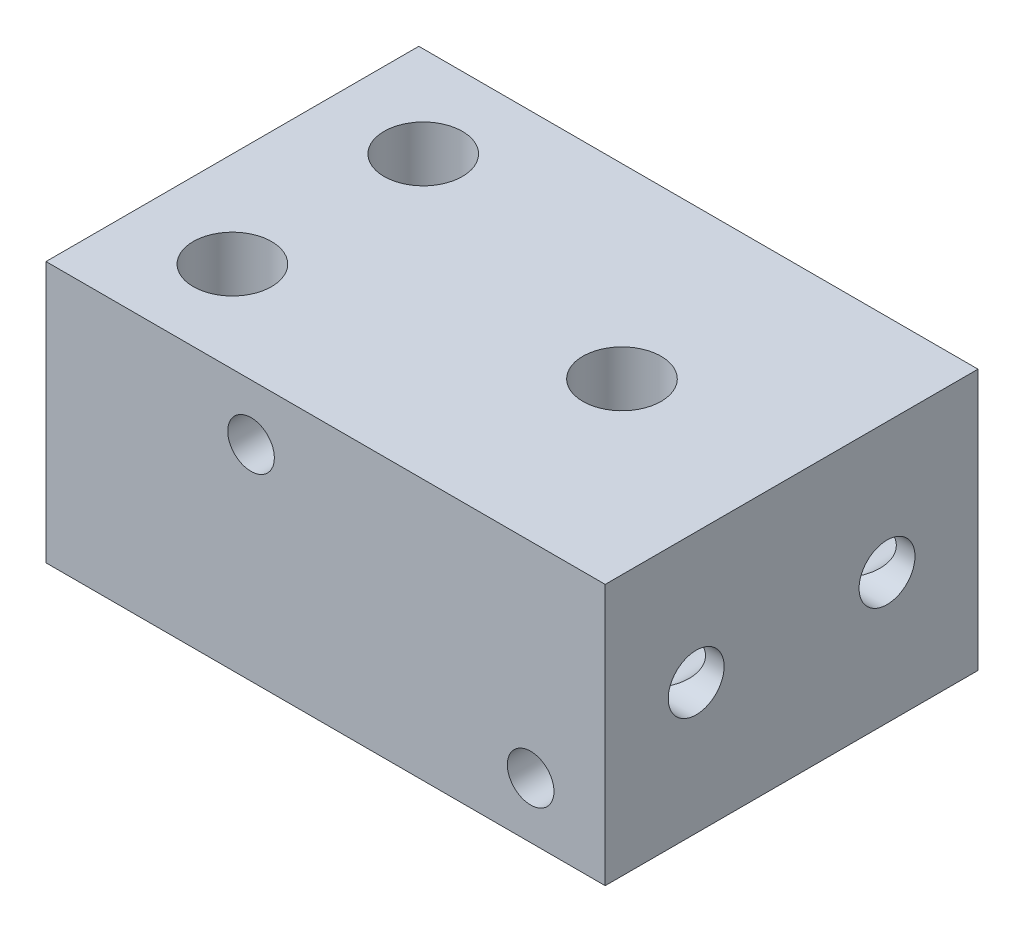
ISO-10303-21;
HEADER;
FILE_DESCRIPTION(('STEP AP214'),'2;1');
FILE_NAME('part.step','',(''),(''),'','','');
FILE_SCHEMA(('AUTOMOTIVE_DESIGN { 1 0 10303 214 1 1 1 1 }'));
ENDSEC;
DATA;
#1=APPLICATION_CONTEXT('core data for automotive mechanical design processes');
#2=APPLICATION_PROTOCOL_DEFINITION('international standard','automotive_design',2000,#1);
#3=PRODUCT_CONTEXT('',#1,'mechanical');
#4=PRODUCT('Part','Part','',(#3));
#5=PRODUCT_RELATED_PRODUCT_CATEGORY('part','',(#4));
#6=PRODUCT_DEFINITION_FORMATION('','',#4);
#7=PRODUCT_DEFINITION_CONTEXT('part definition',#1,'design');
#8=PRODUCT_DEFINITION('design','',#6,#7);
#9=PRODUCT_DEFINITION_SHAPE('','',#8);
#10=(LENGTH_UNIT() NAMED_UNIT(*) SI_UNIT(.MILLI.,.METRE.));
#11=(NAMED_UNIT(*) PLANE_ANGLE_UNIT() SI_UNIT($,.RADIAN.));
#12=(NAMED_UNIT(*) SI_UNIT($,.STERADIAN.) SOLID_ANGLE_UNIT());
#13=UNCERTAINTY_MEASURE_WITH_UNIT(LENGTH_MEASURE(1.E-05),#10,'distance_accuracy_value','');
#14=(GEOMETRIC_REPRESENTATION_CONTEXT(3) GLOBAL_UNCERTAINTY_ASSIGNED_CONTEXT((#13)) GLOBAL_UNIT_ASSIGNED_CONTEXT((#10,
#11,#12)) REPRESENTATION_CONTEXT('',''));
#15=CARTESIAN_POINT('',(0.,0.,0.));
#16=DIRECTION('',(0.,0.,1.));
#17=DIRECTION('',(1.,0.,0.));
#18=AXIS2_PLACEMENT_3D('',#15,#16,#17);
#19=CARTESIAN_POINT('',(12.5,0.,5.));
#20=DIRECTION('',(0.,0.,-1.));
#21=DIRECTION('',(-1.,0.,0.));
#22=AXIS2_PLACEMENT_3D('',#19,#20,#21);
#23=CONICAL_SURFACE('',#22,1.5,1.02974425867665);
#24=CARTESIAN_POINT('',(12.5,0.,5.));
#25=DIRECTION('',(0.,0.,-1.));
#26=DIRECTION('',(-1.,0.,0.));
#27=AXIS2_PLACEMENT_3D('',#24,#25,#26);
#28=CIRCLE('',#27,1.5);
#29=CARTESIAN_POINT('',(12.381197846483,1.49528794829615,5.));
#30=VERTEX_POINT('',#29);
#31=CARTESIAN_POINT('',(12.618802153517,1.49528794829615,5.));
#32=VERTEX_POINT('',#31);
#33=EDGE_CURVE('E201',#30,#32,#28,.T.);
#34=ORIENTED_EDGE('',*,*,#33,.T.);
#35=CARTESIAN_POINT('',(13.5805534889174,1.46712130148021,4.80646405666845));
#36=CARTESIAN_POINT('',(13.5211839333403,1.47120765001717,4.82562818840708));
#37=CARTESIAN_POINT('',(13.4614929430071,1.47471254752651,4.84396772708153));
#38=CARTESIAN_POINT('',(13.3410766330989,1.4807400282696,4.87856374212805));
#39=CARTESIAN_POINT('',(13.2803472627921,1.48325661187412,4.89480710583845));
#40=CARTESIAN_POINT('',(13.1461494135594,1.48785501496003,4.92746003463698));
#41=CARTESIAN_POINT('',(13.0725260388537,1.48975379250092,4.94327314428095));
#42=CARTESIAN_POINT('',(12.9243600891772,1.49264595093046,4.96984422397205));
#43=CARTESIAN_POINT('',(12.8498178478908,1.4936396512178,4.98060397668201));
#44=CARTESIAN_POINT('',(12.7003748398081,1.4949897719448,4.99605176300288));
#45=CARTESIAN_POINT('',(12.6254765881037,1.49534865129621,5.0007632045589));
#46=CARTESIAN_POINT('',(12.4755592029223,1.49557576103578,5.00366486201252));
#47=CARTESIAN_POINT('',(12.4005401003839,1.49544410163823,5.00185654277357));
#48=CARTESIAN_POINT('',(12.2798414819185,1.494789430497,4.99385797566924));
#49=CARTESIAN_POINT('',(12.2340189489433,1.49443717538625,4.98962949763607));
#50=CARTESIAN_POINT('',(12.1426377706661,1.49347866923835,4.97897869691298));
#51=CARTESIAN_POINT('',(12.0970790932178,1.49287244983172,4.97255664744439));
#52=CARTESIAN_POINT('',(12.0061739011284,1.49134427024508,4.95771955192739));
#53=CARTESIAN_POINT('',(11.9608282561015,1.49042148628245,4.94929932390386));
#54=CARTESIAN_POINT('',(11.8705057226256,1.48819161147023,4.93072419356039));
#55=CARTESIAN_POINT('',(11.8255288423373,1.48688451213924,4.92056925295947));
#56=CARTESIAN_POINT('',(11.707731272971,1.4828481686182,4.89190565678009));
#57=CARTESIAN_POINT('',(11.6352228125566,1.47974178042864,4.87216504258061));
#58=CARTESIAN_POINT('',(11.4911596572071,1.47203236519833,4.82968802007176));
#59=CARTESIAN_POINT('',(11.4196052765039,1.46742885715736,4.8069506503518));
#60=CARTESIAN_POINT('',(11.2772941431457,1.45646757905973,4.75921517731361));
#61=CARTESIAN_POINT('',(11.2065384923606,1.45010763581239,4.73421429934292));
#62=CARTESIAN_POINT('',(11.0658400268724,1.43541277364258,4.68255386750521));
#63=CARTESIAN_POINT('',(10.9958972975374,1.42707764922945,4.65589414127062));
#64=CARTESIAN_POINT('',(10.7872784123957,1.39880881562895,4.57414333852019));
#65=CARTESIAN_POINT('',(10.6497319617632,1.37560597661754,4.51725279842159));
#66=CARTESIAN_POINT('',(10.3779157998649,1.31881732231994,4.40122943872389));
#67=CARTESIAN_POINT('',(10.2436422739382,1.28524428607685,4.34209945701003));
#68=CARTESIAN_POINT('',(10.0474977438105,1.22610794996405,4.25401768587328));
#69=CARTESIAN_POINT('',(9.98407489535697,1.20537346967524,4.22526410135167));
#70=CARTESIAN_POINT('',(9.85843536603288,1.16061249939114,4.16785913704675));
#71=CARTESIAN_POINT('',(9.79621764369038,1.13658901124604,4.1392076882338));
#72=CARTESIAN_POINT('',(9.73467523557029,1.11072713994722,4.11069242705632));
#73=B_SPLINE_CURVE_WITH_KNOTS('',3,(#35,#36,#37,#38,#39,#40,#41,#42,#43,#44,#45,#46,#47,#48,#49,
#50,#51,#52,#53,#54,#55,#56,#57,#58,#59,#60,#61,#62,#63,#64,#65,#66,#67,#68,#69,#70,#71,#72),
.UNSPECIFIED.,.F.,.F.,(4,2,2,2,2,2,2,2,2,2,2,2,2,2,2,2,2,2,4),(0.,0.187570776768924,
0.376263236548159,0.602092023812306,0.827841085947331,1.05271380227868,1.27753599723375,
1.41554129961895,1.55352941895275,1.69187937756897,1.83023238963366,2.055759817394,
2.28135977514527,2.50724012201256,2.73314397897271,3.18469869600807,3.63569917380241,
3.85359743659616,4.07129813502256),.UNSPECIFIED.);
#74=EDGE_CURVE('E11',#32,#30,#73,.T.);
#75=ORIENTED_EDGE('',*,*,#74,.T.);
#76=EDGE_LOOP('',(#34,#75));
#77=FACE_BOUND('',#76,.T.);
#78=ADVANCED_FACE('F43',(#77),#23,.F.);
#79=CARTESIAN_POINT('',(12.5,0.,-10.));
#80=DIRECTION('',(0.,0.,-1.));
#81=DIRECTION('',(-1.,0.,0.));
#82=AXIS2_PLACEMENT_3D('',#79,#80,#81);
#83=CYLINDRICAL_SURFACE('',#82,1.49999999999999);
#84=CARTESIAN_POINT('',(12.5,0.,-10.));
#85=DIRECTION('',(0.,0.,-1.));
#86=DIRECTION('',(-1.,0.,0.));
#87=AXIS2_PLACEMENT_3D('',#84,#85,#86);
#88=CIRCLE('',#87,1.49999999999999);
#89=CARTESIAN_POINT('',(11.,0.,-10.));
#90=VERTEX_POINT('',#89);
#91=EDGE_CURVE('E209',#90,#90,#88,.T.);
#92=ORIENTED_EDGE('',*,*,#91,.T.);
#93=EDGE_LOOP('',(#92));
#94=FACE_BOUND('',#93,.T.);
#95=CARTESIAN_POINT('',(12.5,0.,-5.11880215351701));
#96=DIRECTION('',(-0.707106781186547,0.,-0.707106781186547));
#97=DIRECTION('',(0.707106781186547,0.,-0.707106781186547));
#98=AXIS2_PLACEMENT_3D('',#95,#96,#97);
#99=ELLIPSE('',#98,2.12132034355963,1.49999999999999);
#100=CARTESIAN_POINT('',(12.5,-1.49999999999999,-5.11880215351701));
#101=VERTEX_POINT('',#100);
#102=CARTESIAN_POINT('',(12.5,1.49999999999999,-5.11880215351701));
#103=VERTEX_POINT('',#102);
#104=EDGE_CURVE('E70',#101,#103,#99,.F.);
#105=ORIENTED_EDGE('',*,*,#104,.T.);
#106=CARTESIAN_POINT('',(12.5,0.,-5.11880215351701));
#107=DIRECTION('',(0.707106781186547,0.,-0.707106781186547));
#108=DIRECTION('',(-0.707106781186547,0.,-0.707106781186547));
#109=AXIS2_PLACEMENT_3D('',#106,#107,#108);
#110=ELLIPSE('',#109,2.12132034355963,1.49999999999999);
#111=EDGE_CURVE('E351',#103,#101,#110,.F.);
#112=ORIENTED_EDGE('',*,*,#111,.T.);
#113=EDGE_LOOP('',(#105,#112));
#114=FACE_BOUND('',#113,.T.);
#115=ADVANCED_FACE('F188',(#94,#114),#83,.F.);
#116=CARTESIAN_POINT('',(15.,-7.,10.));
#117=DIRECTION('',(-1.,0.,0.));
#118=DIRECTION('',(0.,0.,1.));
#119=AXIS2_PLACEMENT_3D('',#116,#117,#118);
#120=PLANE('',#119);
#121=CARTESIAN_POINT('',(15.,0.,5.11880215351701));
#122=DIRECTION('',(1.,0.,0.));
#123=DIRECTION('',(0.,0.,-1.));
#124=AXIS2_PLACEMENT_3D('',#121,#122,#123);
#125=CIRCLE('',#124,1.49999999999999);
#126=CARTESIAN_POINT('',(15.,0.,3.61880215351702));
#127=VERTEX_POINT('',#126);
#128=EDGE_CURVE('E139',#127,#127,#125,.T.);
#129=ORIENTED_EDGE('',*,*,#128,.F.);
#130=EDGE_LOOP('',(#129));
#131=FACE_BOUND('',#130,.T.);
#132=CARTESIAN_POINT('',(15.,0.,-5.11880215351701));
#133=DIRECTION('',(1.,0.,0.));
#134=DIRECTION('',(0.,0.,-1.));
#135=AXIS2_PLACEMENT_3D('',#132,#133,#134);
#136=CIRCLE('',#135,1.49999999999999);
#137=CARTESIAN_POINT('',(15.,0.,-6.618802153517));
#138=VERTEX_POINT('',#137);
#139=EDGE_CURVE('E152',#138,#138,#136,.T.);
#140=ORIENTED_EDGE('',*,*,#139,.F.);
#141=EDGE_LOOP('',(#140));
#142=FACE_BOUND('',#141,.T.);
#143=DIRECTION('',(0.,1.,0.));
#144=VECTOR('',#143,1.);
#145=CARTESIAN_POINT('',(15.,-7.,-10.));
#146=LINE('',#145,#144);
#147=CARTESIAN_POINT('',(15.,-7.,-10.));
#148=VERTEX_POINT('',#147);
#149=CARTESIAN_POINT('',(15.,7.,-10.));
#150=VERTEX_POINT('',#149);
#151=EDGE_CURVE('E231',#148,#150,#146,.T.);
#152=ORIENTED_EDGE('',*,*,#151,.T.);
#153=DIRECTION('',(0.,0.,-1.));
#154=VECTOR('',#153,1.);
#155=CARTESIAN_POINT('',(15.,7.,10.));
#156=LINE('',#155,#154);
#157=CARTESIAN_POINT('',(15.,7.,10.));
#158=VERTEX_POINT('',#157);
#159=EDGE_CURVE('E174',#158,#150,#156,.T.);
#160=ORIENTED_EDGE('',*,*,#159,.F.);
#161=DIRECTION('',(0.,1.,0.));
#162=VECTOR('',#161,1.);
#163=CARTESIAN_POINT('',(15.,-7.,10.));
#164=LINE('',#163,#162);
#165=CARTESIAN_POINT('',(15.,-7.,10.));
#166=VERTEX_POINT('',#165);
#167=EDGE_CURVE('E232',#166,#158,#164,.T.);
#168=ORIENTED_EDGE('',*,*,#167,.F.);
#169=DIRECTION('',(0.,0.,-1.));
#170=VECTOR('',#169,1.);
#171=CARTESIAN_POINT('',(15.,-7.,10.));
#172=LINE('',#171,#170);
#173=EDGE_CURVE('E242',#166,#148,#172,.T.);
#174=ORIENTED_EDGE('',*,*,#173,.T.);
#175=EDGE_LOOP('',(#152,#160,#168,#174));
#176=FACE_BOUND('',#175,.T.);
#177=ADVANCED_FACE('F45',(#131,#142,#176),#120,.F.);
#178=CARTESIAN_POINT('',(-15.,7.,10.));
#179=DIRECTION('',(0.,-1.,0.));
#180=DIRECTION('',(0.,0.,-1.));
#181=AXIS2_PLACEMENT_3D('',#178,#179,#180);
#182=PLANE('',#181);
#183=CARTESIAN_POINT('',(-9.881197846483,7.,5.11880215351701));
#184=DIRECTION('',(0.,1.,0.));
#185=DIRECTION('',(0.,0.,1.));
#186=AXIS2_PLACEMENT_3D('',#183,#184,#185);
#187=CIRCLE('',#186,2.09999999999999);
#188=CARTESIAN_POINT('',(-9.881197846483,7.,7.218802153517));
#189=VERTEX_POINT('',#188);
#190=EDGE_CURVE('E202',#189,#189,#187,.T.);
#191=ORIENTED_EDGE('',*,*,#190,.F.);
#192=EDGE_LOOP('',(#191));
#193=FACE_BOUND('',#192,.T.);
#194=CARTESIAN_POINT('',(-9.881197846483,7.,-5.11880215351701));
#195=DIRECTION('',(0.,1.,0.));
#196=DIRECTION('',(0.,0.,1.));
#197=AXIS2_PLACEMENT_3D('',#194,#195,#196);
#198=CIRCLE('',#197,2.09999999999999);
#199=CARTESIAN_POINT('',(-9.881197846483,7.,-3.01880215351702));
#200=VERTEX_POINT('',#199);
#201=EDGE_CURVE('E215',#200,#200,#198,.T.);
#202=ORIENTED_EDGE('',*,*,#201,.F.);
#203=EDGE_LOOP('',(#202));
#204=FACE_BOUND('',#203,.T.);
#205=CARTESIAN_POINT('',(5.90000000000001,7.,0.));
#206=DIRECTION('',(0.,1.,0.));
#207=DIRECTION('',(0.,0.,1.));
#208=AXIS2_PLACEMENT_3D('',#205,#206,#207);
#209=CIRCLE('',#208,2.09999999999999);
#210=CARTESIAN_POINT('',(5.90000000000001,7.,2.09999999999999));
#211=VERTEX_POINT('',#210);
#212=EDGE_CURVE('E221',#211,#211,#209,.T.);
#213=ORIENTED_EDGE('',*,*,#212,.F.);
#214=EDGE_LOOP('',(#213));
#215=FACE_BOUND('',#214,.T.);
#216=DIRECTION('',(-1.,0.,0.));
#217=VECTOR('',#216,1.);
#218=CARTESIAN_POINT('',(-15.,7.,-10.));
#219=LINE('',#218,#217);
#220=CARTESIAN_POINT('',(-15.,7.,-10.));
#221=VERTEX_POINT('',#220);
#222=EDGE_CURVE('E245',#150,#221,#219,.T.);
#223=ORIENTED_EDGE('',*,*,#222,.T.);
#224=DIRECTION('',(0.,0.,-1.));
#225=VECTOR('',#224,1.);
#226=CARTESIAN_POINT('',(-15.,7.,10.));
#227=LINE('',#226,#225);
#228=CARTESIAN_POINT('',(-15.,7.,10.));
#229=VERTEX_POINT('',#228);
#230=EDGE_CURVE('E255',#229,#221,#227,.T.);
#231=ORIENTED_EDGE('',*,*,#230,.F.);
#232=DIRECTION('',(-1.,0.,0.));
#233=VECTOR('',#232,1.);
#234=CARTESIAN_POINT('',(-15.,7.,10.));
#235=LINE('',#234,#233);
#236=EDGE_CURVE('E235',#158,#229,#235,.T.);
#237=ORIENTED_EDGE('',*,*,#236,.F.);
#238=ORIENTED_EDGE('',*,*,#159,.T.);
#239=EDGE_LOOP('',(#223,#231,#237,#238));
#240=FACE_BOUND('',#239,.T.);
#241=ADVANCED_FACE('F294',(#193,#204,#215,#240),#182,.F.);
#242=CARTESIAN_POINT('',(-15.,-7.,10.));
#243=DIRECTION('',(1.,0.,0.));
#244=DIRECTION('',(0.,0.,-1.));
#245=AXIS2_PLACEMENT_3D('',#242,#243,#244);
#246=PLANE('',#245);
#247=DIRECTION('',(0.,-1.,0.));
#248=VECTOR('',#247,1.);
#249=CARTESIAN_POINT('',(-15.,-7.,-10.));
#250=LINE('',#249,#248);
#251=CARTESIAN_POINT('',(-15.,-7.,-10.));
#252=VERTEX_POINT('',#251);
#253=EDGE_CURVE('E247',#221,#252,#250,.T.);
#254=ORIENTED_EDGE('',*,*,#253,.T.);
#255=DIRECTION('',(0.,0.,-1.));
#256=VECTOR('',#255,1.);
#257=CARTESIAN_POINT('',(-15.,-7.,10.));
#258=LINE('',#257,#256);
#259=CARTESIAN_POINT('',(-15.,-7.,10.));
#260=VERTEX_POINT('',#259);
#261=EDGE_CURVE('E252',#260,#252,#258,.T.);
#262=ORIENTED_EDGE('',*,*,#261,.F.);
#263=DIRECTION('',(0.,-1.,0.));
#264=VECTOR('',#263,1.);
#265=CARTESIAN_POINT('',(-15.,-7.,10.));
#266=LINE('',#265,#264);
#267=EDGE_CURVE('E238',#229,#260,#266,.T.);
#268=ORIENTED_EDGE('',*,*,#267,.F.);
#269=ORIENTED_EDGE('',*,*,#230,.T.);
#270=EDGE_LOOP('',(#254,#262,#268,#269));
#271=FACE_BOUND('',#270,.T.);
#272=ADVANCED_FACE('F291',(#271),#246,.F.);
#273=CARTESIAN_POINT('',(-15.,-7.,10.));
#274=DIRECTION('',(0.,1.,0.));
#275=DIRECTION('',(0.,0.,1.));
#276=AXIS2_PLACEMENT_3D('',#273,#274,#275);
#277=PLANE('',#276);
#278=CARTESIAN_POINT('',(5.90000000000001,-7.,0.));
#279=DIRECTION('',(0.,1.,0.));
#280=DIRECTION('',(0.,0.,1.));
#281=AXIS2_PLACEMENT_3D('',#278,#279,#280);
#282=CIRCLE('',#281,1.);
#283=CARTESIAN_POINT('',(5.90000000000001,-7.,1.));
#284=VERTEX_POINT('',#283);
#285=EDGE_CURVE('E228',#284,#284,#282,.T.);
#286=ORIENTED_EDGE('',*,*,#285,.T.);
#287=EDGE_LOOP('',(#286));
#288=FACE_BOUND('',#287,.T.);
#289=DIRECTION('',(1.,0.,0.));
#290=VECTOR('',#289,1.);
#291=CARTESIAN_POINT('',(-15.,-7.,-10.));
#292=LINE('',#291,#290);
#293=EDGE_CURVE('E236',#252,#148,#292,.T.);
#294=ORIENTED_EDGE('',*,*,#293,.T.);
#295=ORIENTED_EDGE('',*,*,#173,.F.);
#296=DIRECTION('',(1.,0.,0.));
#297=VECTOR('',#296,1.);
#298=CARTESIAN_POINT('',(-15.,-7.,10.));
#299=LINE('',#298,#297);
#300=EDGE_CURVE('E240',#260,#166,#299,.T.);
#301=ORIENTED_EDGE('',*,*,#300,.F.);
#302=ORIENTED_EDGE('',*,*,#261,.T.);
#303=EDGE_LOOP('',(#294,#295,#301,#302));
#304=FACE_BOUND('',#303,.T.);
#305=ADVANCED_FACE('F284',(#288,#304),#277,.F.);
#306=CARTESIAN_POINT('',(0.,0.,10.));
#307=DIRECTION('',(0.,0.,-1.));
#308=DIRECTION('',(-1.,0.,0.));
#309=AXIS2_PLACEMENT_3D('',#306,#307,#308);
#310=PLANE('',#309);
#311=CARTESIAN_POINT('',(-4.,4.,10.));
#312=DIRECTION('',(0.,0.,1.));
#313=DIRECTION('',(1.,0.,0.));
#314=AXIS2_PLACEMENT_3D('',#311,#312,#313);
#315=CIRCLE('',#314,1.25);
#316=CARTESIAN_POINT('',(-2.75,4.,10.));
#317=VERTEX_POINT('',#316);
#318=EDGE_CURVE('E129',#317,#317,#315,.T.);
#319=ORIENTED_EDGE('',*,*,#318,.F.);
#320=EDGE_LOOP('',(#319));
#321=FACE_BOUND('',#320,.T.);
#322=CARTESIAN_POINT('',(11.,-4.,10.));
#323=DIRECTION('',(0.,0.,1.));
#324=DIRECTION('',(1.,0.,0.));
#325=AXIS2_PLACEMENT_3D('',#322,#323,#324);
#326=CIRCLE('',#325,1.25);
#327=CARTESIAN_POINT('',(12.25,-4.,10.));
#328=VERTEX_POINT('',#327);
#329=EDGE_CURVE('E128',#328,#328,#326,.T.);
#330=ORIENTED_EDGE('',*,*,#329,.F.);
#331=EDGE_LOOP('',(#330));
#332=FACE_BOUND('',#331,.T.);
#333=ORIENTED_EDGE('',*,*,#167,.T.);
#334=ORIENTED_EDGE('',*,*,#236,.T.);
#335=ORIENTED_EDGE('',*,*,#267,.T.);
#336=ORIENTED_EDGE('',*,*,#300,.T.);
#337=EDGE_LOOP('',(#333,#334,#335,#336));
#338=FACE_BOUND('',#337,.T.);
#339=ADVANCED_FACE('F281',(#321,#332,#338),#310,.F.);
#340=CARTESIAN_POINT('',(0.,0.,-10.));
#341=DIRECTION('',(0.,0.,-1.));
#342=DIRECTION('',(-1.,0.,0.));
#343=AXIS2_PLACEMENT_3D('',#340,#341,#342);
#344=PLANE('',#343);
#345=ORIENTED_EDGE('',*,*,#91,.F.);
#346=EDGE_LOOP('',(#345));
#347=FACE_BOUND('',#346,.T.);
#348=ORIENTED_EDGE('',*,*,#151,.F.);
#349=ORIENTED_EDGE('',*,*,#293,.F.);
#350=ORIENTED_EDGE('',*,*,#253,.F.);
#351=ORIENTED_EDGE('',*,*,#222,.F.);
#352=EDGE_LOOP('',(#348,#349,#350,#351));
#353=FACE_BOUND('',#352,.T.);
#354=ADVANCED_FACE('F277',(#347,#353),#344,.T.);
#355=CARTESIAN_POINT('',(5.90000000000001,-7.,0.));
#356=DIRECTION('',(0.,1.,0.));
#357=DIRECTION('',(0.,0.,1.));
#358=AXIS2_PLACEMENT_3D('',#355,#356,#357);
#359=CYLINDRICAL_SURFACE('',#358,1.);
#360=CARTESIAN_POINT('',(5.90000000000001,-1.66094668093032,0.));
#361=DIRECTION('',(0.,1.,0.));
#362=DIRECTION('',(0.,0.,1.));
#363=AXIS2_PLACEMENT_3D('',#360,#361,#362);
#364=CIRCLE('',#363,1.);
#365=CARTESIAN_POINT('',(5.90000000000001,-1.66094668093032,1.));
#366=VERTEX_POINT('',#365);
#367=EDGE_CURVE('E227',#366,#366,#364,.T.);
#368=ORIENTED_EDGE('',*,*,#367,.T.);
#369=EDGE_LOOP('',(#368));
#370=FACE_BOUND('',#369,.T.);
#371=ORIENTED_EDGE('',*,*,#285,.F.);
#372=EDGE_LOOP('',(#371));
#373=FACE_BOUND('',#372,.T.);
#374=ADVANCED_FACE('F262',(#370,#373),#359,.F.);
#375=CARTESIAN_POINT('',(5.90000000000001,-1.,0.));
#376=DIRECTION('',(0.,1.,0.));
#377=DIRECTION('',(0.,0.,1.));
#378=AXIS2_PLACEMENT_3D('',#375,#376,#377);
#379=CONICAL_SURFACE('',#378,2.1,1.02974425867665);
#380=CARTESIAN_POINT('',(5.90000000000001,-1.,0.));
#381=DIRECTION('',(0.,1.,0.));
#382=DIRECTION('',(0.,0.,1.));
#383=AXIS2_PLACEMENT_3D('',#380,#381,#382);
#384=CIRCLE('',#383,2.1);
#385=CARTESIAN_POINT('',(5.90000000000001,-1.,2.1));
#386=VERTEX_POINT('',#385);
#387=EDGE_CURVE('E224',#386,#386,#384,.T.);
#388=ORIENTED_EDGE('',*,*,#387,.T.);
#389=EDGE_LOOP('',(#388));
#390=FACE_BOUND('',#389,.T.);
#391=ORIENTED_EDGE('',*,*,#367,.F.);
#392=EDGE_LOOP('',(#391));
#393=FACE_BOUND('',#392,.T.);
#394=ADVANCED_FACE('F265',(#390,#393),#379,.F.);
#395=CARTESIAN_POINT('',(5.90000000000001,7.,0.));
#396=DIRECTION('',(0.,1.,0.));
#397=DIRECTION('',(0.,0.,1.));
#398=AXIS2_PLACEMENT_3D('',#395,#396,#397);
#399=CYLINDRICAL_SURFACE('',#398,2.09999999999999);
#400=ORIENTED_EDGE('',*,*,#387,.F.);
#401=EDGE_LOOP('',(#400));
#402=FACE_BOUND('',#401,.T.);
#403=ORIENTED_EDGE('',*,*,#212,.T.);
#404=EDGE_LOOP('',(#403));
#405=FACE_BOUND('',#404,.T.);
#406=ADVANCED_FACE('F267',(#402,#405),#399,.F.);
#407=CARTESIAN_POINT('',(-9.881197846483,-3.,-5.11880215351701));
#408=DIRECTION('',(0.,1.,0.));
#409=DIRECTION('',(0.,0.,1.));
#410=AXIS2_PLACEMENT_3D('',#407,#408,#409);
#411=CONICAL_SURFACE('',#410,2.1,1.02974425867665);
#412=CARTESIAN_POINT('',(-9.881197846483,-4.26180729995788,-5.11880215351701));
#413=VERTEX_POINT('',#412);
#414=VERTEX_LOOP('',#413);
#415=FACE_BOUND('',#414,.T.);
#416=CARTESIAN_POINT('',(-9.881197846483,-3.,-5.11880215351701));
#417=DIRECTION('',(0.,1.,0.));
#418=DIRECTION('',(0.,0.,1.));
#419=AXIS2_PLACEMENT_3D('',#416,#417,#418);
#420=CIRCLE('',#419,2.1);
#421=CARTESIAN_POINT('',(-9.881197846483,-3.,-3.01880215351701));
#422=VERTEX_POINT('',#421);
#423=EDGE_CURVE('E218',#422,#422,#420,.T.);
#424=ORIENTED_EDGE('',*,*,#423,.T.);
#425=EDGE_LOOP('',(#424));
#426=FACE_BOUND('',#425,.T.);
#427=ADVANCED_FACE('F274',(#415,#426),#411,.F.);
#428=CARTESIAN_POINT('',(-9.881197846483,7.,-5.11880215351701));
#429=DIRECTION('',(0.,1.,0.));
#430=DIRECTION('',(0.,0.,1.));
#431=AXIS2_PLACEMENT_3D('',#428,#429,#430);
#432=CYLINDRICAL_SURFACE('',#431,2.09999999999999);
#433=CARTESIAN_POINT('',(-8.4115040008131,0.,-6.618802153517));
#434=CARTESIAN_POINT('',(-8.41150618717333,0.0714635636138938,-6.61880352006278));
#435=CARTESIAN_POINT('',(-8.40618852010885,0.142920740316055,-6.61364783815958));
#436=CARTESIAN_POINT('',(-8.38610006506222,0.283150153378352,-6.59354628850496));
#437=CARTESIAN_POINT('',(-8.37130600829953,0.351915337444897,-6.57857632015417));
#438=CARTESIAN_POINT('',(-8.33511093691571,0.48415055796895,-6.54017258808949));
#439=CARTESIAN_POINT('',(-8.31378937465276,0.547673201048448,-6.51684005947936));
#440=CARTESIAN_POINT('',(-8.26708446422067,0.669734416739172,-6.46264657396994));
#441=CARTESIAN_POINT('',(-8.24170127424767,0.728273183331163,-6.43178591025907));
#442=CARTESIAN_POINT('',(-8.18415863966758,0.8505097655526,-6.35681650320226));
#443=CARTESIAN_POINT('',(-8.15161236381743,0.913170962990344,-6.31131447289605));
#444=CARTESIAN_POINT('',(-8.08666303022985,1.03090307484068,-6.21114784782687));
#445=CARTESIAN_POINT('',(-8.054260221023,1.08596376715725,-6.15647112848489));
#446=CARTESIAN_POINT('',(-7.98655330229606,1.19662789276359,-6.02791627240018));
#447=CARTESIAN_POINT('',(-7.95174784370755,1.25060895645527,-5.95235240485679));
#448=CARTESIAN_POINT('',(-7.88956245644219,1.34456168876167,-5.79027333758927));
#449=CARTESIAN_POINT('',(-7.86216694163587,1.38456281550647,-5.70378169497843));
#450=CARTESIAN_POINT('',(-7.82434046728451,1.43907144230565,-5.54762580808035));
#451=CARTESIAN_POINT('',(-7.81131019153573,1.45757548414395,-5.47997530299121));
#452=CARTESIAN_POINT('',(-7.79191509189284,1.484991166103,-5.3418391791467));
#453=CARTESIAN_POINT('',(-7.78554481953725,1.49391064739356,-5.27135592692715));
#454=CARTESIAN_POINT('',(-7.78002090611578,1.50164969655121,-5.12939938572692));
#455=CARTESIAN_POINT('',(-7.78088256856283,1.50044784662913,-5.05792431697499));
#456=CARTESIAN_POINT('',(-7.78977884112203,1.48796917601259,-4.91631009785875));
#457=CARTESIAN_POINT('',(-7.79781536293772,1.47668967017913,-4.84617130862638));
#458=CARTESIAN_POINT('',(-7.82006651979702,1.44512395679308,-4.71098595534768));
#459=CARTESIAN_POINT('',(-7.83411521385567,1.42507937005225,-4.6458544341617));
#460=CARTESIAN_POINT('',(-7.86731467180602,1.37696332909894,-4.520042490158));
#461=CARTESIAN_POINT('',(-7.88646647346712,1.3488902421232,-4.45936297590631));
#462=CARTESIAN_POINT('',(-7.93101356486319,1.28214889417871,-4.33682263759808));
#463=CARTESIAN_POINT('',(-7.95686692100209,1.24264824455404,-4.27558458977849));
#464=CARTESIAN_POINT('',(-8.01163291678444,1.15602759022427,-4.16025551082126));
#465=CARTESIAN_POINT('',(-8.04054864791441,1.10889986010106,-4.10617182831018));
#466=CARTESIAN_POINT('',(-8.10505800127426,0.998521429008189,-3.99626255818297));
#467=CARTESIAN_POINT('',(-8.14089961226402,0.933900211000362,-3.94195562274872));
#468=CARTESIAN_POINT('',(-8.21091993301691,0.795848226879714,-3.84453254227469));
#469=CARTESIAN_POINT('',(-8.2450987347209,0.722417948621627,-3.8014157779298));
#470=CARTESIAN_POINT('',(-8.3004201264612,0.584701290547808,-3.7358519151872));
#471=CARTESIAN_POINT('',(-8.32276493911208,0.522081275425057,-3.71093659562487));
#472=CARTESIAN_POINT('',(-8.36128460765393,0.392366677023455,-3.66943391099772));
#473=CARTESIAN_POINT('',(-8.37747087129232,0.325280639989664,-3.65283113004995));
#474=CARTESIAN_POINT('',(-8.40121936811433,0.187065072458757,-3.62884655950669));
#475=CARTESIAN_POINT('',(-8.40867942591543,0.115897675975786,-3.62157392329647));
#476=CARTESIAN_POINT('',(-8.41298607583699,-0.0270490375900716,-3.61734635010008));
#477=CARTESIAN_POINT('',(-8.40984023173068,-0.0988278821831936,-3.62038406013147));
#478=CARTESIAN_POINT('',(-8.3949798959663,-0.228834278132264,-3.63514772173579));
#479=CARTESIAN_POINT('',(-8.3846986499103,-0.287410218875746,-3.64542422357658));
#480=CARTESIAN_POINT('',(-8.35859205746869,-0.401788526424376,-3.67241894623339));
#481=CARTESIAN_POINT('',(-8.34276018770059,-0.457587541140687,-3.68914474892268));
#482=CARTESIAN_POINT('',(-8.29865693824673,-0.591756433291978,-3.73782872267146));
#483=CARTESIAN_POINT('',(-8.26806234851995,-0.668103199271479,-3.77324477812897));
#484=CARTESIAN_POINT('',(-8.20300471404867,-0.812722312389519,-3.85530685035193));
#485=CARTESIAN_POINT('',(-8.16853400056769,-0.880978084019236,-3.90197534583229));
#486=CARTESIAN_POINT('',(-8.0985588524004,-1.01035556140025,-4.00692540680899));
#487=CARTESIAN_POINT('',(-8.06304869827994,-1.0712804683555,-4.06544624787318));
#488=CARTESIAN_POINT('',(-7.99499963671742,-1.18309069807821,-4.19281203449228));
#489=CARTESIAN_POINT('',(-7.96245666834165,-1.23398985647099,-4.26164251826267));
#490=CARTESIAN_POINT('',(-7.90764089116034,-1.31748268396353,-4.39794008289675));
#491=CARTESIAN_POINT('',(-7.88456088902442,-1.35167082757653,-4.46410036068917));
#492=CARTESIAN_POINT('',(-7.84442581645036,-1.41028283943848,-4.60234556560133));
#493=CARTESIAN_POINT('',(-7.82736731915645,-1.43471226244915,-4.67442709403205));
#494=CARTESIAN_POINT('',(-7.80071189555121,-1.47261860321627,-4.82329384709438));
#495=CARTESIAN_POINT('',(-7.7911630352546,-1.48602499161945,-4.90010603230685));
#496=CARTESIAN_POINT('',(-7.78071329071332,-1.50068767663068,-5.05545670335732));
#497=CARTESIAN_POINT('',(-7.77980785126913,-1.50195037313097,-5.13399425802489));
#498=CARTESIAN_POINT('',(-7.78634844290883,-1.49278266583846,-5.28149175567095));
#499=CARTESIAN_POINT('',(-7.79290781257172,-1.48359375667473,-5.35057428145626));
#500=CARTESIAN_POINT('',(-7.81240738805193,-1.45601815982996,-5.48593050221238));
#501=CARTESIAN_POINT('',(-7.82534867626143,-1.43762991190633,-5.55220371864477));
#502=CARTESIAN_POINT('',(-7.85699295468042,-1.39200633461398,-5.68197546386741));
#503=CARTESIAN_POINT('',(-7.87582424905759,-1.36457317474537,-5.74537212982538));
#504=CARTESIAN_POINT('',(-7.91782926224488,-1.3020566279193,-5.86667224423049));
#505=CARTESIAN_POINT('',(-7.94100378243088,-1.26697182894922,-5.92457467595263));
#506=CARTESIAN_POINT('',(-7.99411908685997,-1.18415843707599,-6.04278911277192));
#507=CARTESIAN_POINT('',(-8.02455221226016,-1.13531449448497,-6.10209664917214));
#508=CARTESIAN_POINT('',(-8.08719878042027,-1.02968128612439,-6.21223424237738));
#509=CARTESIAN_POINT('',(-8.11941545339451,-0.972877298733635,-6.26304820004831));
#510=CARTESIAN_POINT('',(-8.1886830183136,-0.841580088256161,-6.36368146916034));
#511=CARTESIAN_POINT('',(-8.22561157625824,-0.76572502023064,-6.4118242883054));
#512=CARTESIAN_POINT('',(-8.29368736829738,-0.604558389784386,-6.49454817671247));
#513=CARTESIAN_POINT('',(-8.32484486295063,-0.519264049738337,-6.52915343909789));
#514=CARTESIAN_POINT('',(-8.36906867135897,-0.361652593881851,-6.57628696668147));
#515=CARTESIAN_POINT('',(-8.38467393115815,-0.291062581962284,-6.5921061682334));
#516=CARTESIAN_POINT('',(-8.40587473495606,-0.146972862947468,-6.61334671003374));
#517=CARTESIAN_POINT('',(-8.41150175266843,-0.0734830549796958,-6.61880074835396));
#518=CARTESIAN_POINT('',(-8.4115040008131,0.,-6.618802153517));
#519=B_SPLINE_CURVE_WITH_KNOTS('',3,(#433,#434,#435,#436,#437,#438,#439,#440,#441,#442,#443,
#444,#445,#446,#447,#448,#449,#450,#451,#452,#453,#454,#455,#456,#457,#458,#459,#460,#461,#462,
#463,#464,#465,#466,#467,#468,#469,#470,#471,#472,#473,#474,#475,#476,#477,#478,#479,#480,#481,
#482,#483,#484,#485,#486,#487,#488,#489,#490,#491,#492,#493,#494,#495,#496,#497,#498,#499,#500,
#501,#502,#503,#504,#505,#506,#507,#508,#509,#510,#511,#512,#513,#514,#515,#516,#517,#518),
.UNSPECIFIED.,.T.,.F.,(4,2,2,2,2,2,2,2,2,2,2,2,2,2,2,2,2,2,2,2,2,2,2,2,2,2,2,2,2,2,2,2,2,2,2,2,
2,2,2,2,2,2,4),(0.,0.214041341565725,0.428610275712224,0.64066487160188,0.85271121019711,
1.10382573355409,1.3552747629518,1.65114310955597,1.94638419755253,2.15947902773154,
2.37239939108384,2.58577042909475,2.79919833566903,3.00708108528782,3.21500614230805,
3.44611668475211,3.67746279969138,3.95147971727034,4.22548146651263,4.43776026411786,
4.64964391165512,4.86398443491502,5.07817213005315,5.25849876334786,5.43903804027731,
5.70624218404038,5.973984602927,6.2477965044865,6.5212278542102,6.75417807949529,
6.98699551758326,7.22129126143318,7.45546352144077,7.66448115880017,7.87353425836429,
8.0875021745455,8.30150960924377,8.54850648356665,8.79596634520377,9.08601786485972,
9.37554863589208,9.5963362422679,9.81642618565752),.UNSPECIFIED.);
#520=CARTESIAN_POINT('',(-8.4115040008131,0.,-6.618802153517));
#521=VERTEX_POINT('',#520);
#522=EDGE_CURVE('E175',#521,#521,#519,.T.);
#523=ORIENTED_EDGE('',*,*,#522,.T.);
#524=EDGE_LOOP('',(#523));
#525=FACE_BOUND('',#524,.T.);
#526=ORIENTED_EDGE('',*,*,#423,.F.);
#527=EDGE_LOOP('',(#526));
#528=FACE_BOUND('',#527,.T.);
#529=ORIENTED_EDGE('',*,*,#201,.T.);
#530=EDGE_LOOP('',(#529));
#531=FACE_BOUND('',#530,.T.);
#532=ADVANCED_FACE('F324',(#525,#528,#531),#432,.F.);
#533=CARTESIAN_POINT('',(-9.881197846483,-3.,5.11880215351701));
#534=DIRECTION('',(0.,1.,0.));
#535=DIRECTION('',(0.,0.,1.));
#536=AXIS2_PLACEMENT_3D('',#533,#534,#535);
#537=CONICAL_SURFACE('',#536,2.1,1.02974425867665);
#538=CARTESIAN_POINT('',(-9.881197846483,-4.26180729995788,5.11880215351701));
#539=VERTEX_POINT('',#538);
#540=VERTEX_LOOP('',#539);
#541=FACE_BOUND('',#540,.T.);
#542=CARTESIAN_POINT('',(-9.881197846483,-3.,5.11880215351701));
#543=DIRECTION('',(0.,1.,0.));
#544=DIRECTION('',(0.,0.,1.));
#545=AXIS2_PLACEMENT_3D('',#542,#543,#544);
#546=CIRCLE('',#545,2.1);
#547=CARTESIAN_POINT('',(-9.881197846483,-3.,7.218802153517));
#548=VERTEX_POINT('',#547);
#549=EDGE_CURVE('E206',#548,#548,#546,.T.);
#550=ORIENTED_EDGE('',*,*,#549,.T.);
#551=EDGE_LOOP('',(#550));
#552=FACE_BOUND('',#551,.T.);
#553=ADVANCED_FACE('F326',(#541,#552),#537,.F.);
#554=CARTESIAN_POINT('',(-9.881197846483,7.,5.11880215351701));
#555=DIRECTION('',(0.,1.,0.));
#556=DIRECTION('',(0.,0.,1.));
#557=AXIS2_PLACEMENT_3D('',#554,#555,#556);
#558=CYLINDRICAL_SURFACE('',#557,2.09999999999999);
#559=CARTESIAN_POINT('',(-8.4115040008131,0.,3.61880215351702));
#560=CARTESIAN_POINT('',(-8.41150618717333,0.0714635636138938,3.61880078697124));
#561=CARTESIAN_POINT('',(-8.40618852010885,0.142920740316055,3.62395646887443));
#562=CARTESIAN_POINT('',(-8.38610006506222,0.283150153378352,3.64405801852906));
#563=CARTESIAN_POINT('',(-8.37130600829953,0.351915337444897,3.65902798687985));
#564=CARTESIAN_POINT('',(-8.33511093691571,0.48415055796895,3.69743171894452));
#565=CARTESIAN_POINT('',(-8.31378937465276,0.547673201048448,3.72076424755465));
#566=CARTESIAN_POINT('',(-8.26708446422067,0.669734416739173,3.77495773306407));
#567=CARTESIAN_POINT('',(-8.24170127424767,0.728273183331164,3.80581839677494));
#568=CARTESIAN_POINT('',(-8.18415863966758,0.850509765552601,3.88078780383175));
#569=CARTESIAN_POINT('',(-8.15161236381743,0.913170962990343,3.92628983413796));
#570=CARTESIAN_POINT('',(-8.08666303022985,1.03090307484067,4.02645645920715));
#571=CARTESIAN_POINT('',(-8.054260221023,1.08596376715725,4.08113317854913));
#572=CARTESIAN_POINT('',(-7.98655330229606,1.19662789276359,4.20968803463383));
#573=CARTESIAN_POINT('',(-7.95174784370755,1.25060895645527,4.28525190217723));
#574=CARTESIAN_POINT('',(-7.88956245644219,1.34456168876167,4.44733096944474));
#575=CARTESIAN_POINT('',(-7.86216694163587,1.38456281550647,4.53382261205559));
#576=CARTESIAN_POINT('',(-7.82434046728451,1.43907144230565,4.68997849895366));
#577=CARTESIAN_POINT('',(-7.81131019153573,1.45757548414395,4.7576290040428));
#578=CARTESIAN_POINT('',(-7.79191509189284,1.484991166103,4.89576512788731));
#579=CARTESIAN_POINT('',(-7.78554481953725,1.49391064739356,4.96624838010686));
#580=CARTESIAN_POINT('',(-7.78002090611578,1.50164969655121,5.1082049213071));
#581=CARTESIAN_POINT('',(-7.78088256856283,1.50044784662913,5.17967999005903));
#582=CARTESIAN_POINT('',(-7.78977884112203,1.48796917601259,5.32129420917527));
#583=CARTESIAN_POINT('',(-7.79781536293772,1.47668967017913,5.39143299840764));
#584=CARTESIAN_POINT('',(-7.82006651979702,1.44512395679309,5.52661835168633));
#585=CARTESIAN_POINT('',(-7.83411521385567,1.42507937005225,5.59174987287231));
#586=CARTESIAN_POINT('',(-7.86731467180602,1.37696332909894,5.71756181687601));
#587=CARTESIAN_POINT('',(-7.88646647346712,1.3488902421232,5.77824133112771));
#588=CARTESIAN_POINT('',(-7.93101356486319,1.28214889417871,5.90078166943593));
#589=CARTESIAN_POINT('',(-7.95686692100209,1.24264824455404,5.96201971725553));
#590=CARTESIAN_POINT('',(-8.01163291678444,1.15602759022427,6.07734879621275));
#591=CARTESIAN_POINT('',(-8.04054864791441,1.10889986010106,6.13143247872383));
#592=CARTESIAN_POINT('',(-8.10505800127426,0.99852142900819,6.24134174885104));
#593=CARTESIAN_POINT('',(-8.14089961226402,0.933900211000363,6.2956486842853));
#594=CARTESIAN_POINT('',(-8.21091993301691,0.795848226879715,6.39307176475933));
#595=CARTESIAN_POINT('',(-8.2450987347209,0.722417948621628,6.43618852910422));
#596=CARTESIAN_POINT('',(-8.3004201264612,0.584701290547808,6.50175239184681));
#597=CARTESIAN_POINT('',(-8.32276493911208,0.522081275425058,6.52666771140915));
#598=CARTESIAN_POINT('',(-8.36128460765393,0.392366677023456,6.56817039603629));
#599=CARTESIAN_POINT('',(-8.37747087129232,0.325280639989665,6.58477317698406));
#600=CARTESIAN_POINT('',(-8.40121936811434,0.187065072458759,6.60875774752733));
#601=CARTESIAN_POINT('',(-8.40867942591543,0.115897675975788,6.61603038373755));
#602=CARTESIAN_POINT('',(-8.41298607583699,-0.0270490375900704,6.62025795693394));
#603=CARTESIAN_POINT('',(-8.40984023173068,-0.0988278821831922,6.61722024690255));
#604=CARTESIAN_POINT('',(-8.3949798959663,-0.228834278132263,6.60245658529822));
#605=CARTESIAN_POINT('',(-8.3846986499103,-0.287410218875744,6.59218008345744));
#606=CARTESIAN_POINT('',(-8.35859205746869,-0.401788526424374,6.56518536080062));
#607=CARTESIAN_POINT('',(-8.34276018770059,-0.457587541140686,6.54845955811133));
#608=CARTESIAN_POINT('',(-8.29865693824673,-0.591756433291976,6.49977558436255));
#609=CARTESIAN_POINT('',(-8.26806234851995,-0.668103199271477,6.46435952890505));
#610=CARTESIAN_POINT('',(-8.20300471404868,-0.812722312389517,6.38229745668209));
#611=CARTESIAN_POINT('',(-8.16853400056769,-0.880978084019234,6.33562896120173));
#612=CARTESIAN_POINT('',(-8.09855885240041,-1.01035556140025,6.23067890022503));
#613=CARTESIAN_POINT('',(-8.06304869827994,-1.0712804683555,6.17215805916084));
#614=CARTESIAN_POINT('',(-7.99499963671742,-1.1830906980782,6.04479227254174));
#615=CARTESIAN_POINT('',(-7.96245666834165,-1.23398985647098,5.97596178877134));
#616=CARTESIAN_POINT('',(-7.90764089116035,-1.31748268396352,5.83966422413727));
#617=CARTESIAN_POINT('',(-7.88456088902442,-1.35167082757653,5.77350394634485));
#618=CARTESIAN_POINT('',(-7.84442581645036,-1.41028283943848,5.63525874143269));
#619=CARTESIAN_POINT('',(-7.82736731915645,-1.43471226244915,5.56317721300197));
#620=CARTESIAN_POINT('',(-7.80071189555121,-1.47261860321627,5.41431045993964));
#621=CARTESIAN_POINT('',(-7.7911630352546,-1.48602499161945,5.33749827472717));
#622=CARTESIAN_POINT('',(-7.78071329071332,-1.50068767663068,5.1821476036767));
#623=CARTESIAN_POINT('',(-7.77980785126913,-1.50195037313097,5.10361004900913));
#624=CARTESIAN_POINT('',(-7.78634844290883,-1.49278266583846,4.95611255136307));
#625=CARTESIAN_POINT('',(-7.79290781257172,-1.48359375667473,4.88703002557776));
#626=CARTESIAN_POINT('',(-7.81240738805193,-1.45601815982996,4.75167380482164));
#627=CARTESIAN_POINT('',(-7.82534867626143,-1.43762991190633,4.68540058838925));
#628=CARTESIAN_POINT('',(-7.85699295468042,-1.39200633461399,4.55562884316661));
#629=CARTESIAN_POINT('',(-7.87582424905759,-1.36457317474537,4.49223217720864));
#630=CARTESIAN_POINT('',(-7.91782926224487,-1.3020566279193,4.37093206280353));
#631=CARTESIAN_POINT('',(-7.94100378243087,-1.26697182894922,4.31302963108139));
#632=CARTESIAN_POINT('',(-7.99411908685996,-1.184158437076,4.19481519426209));
#633=CARTESIAN_POINT('',(-8.02455221226016,-1.13531449448497,4.13550765786188));
#634=CARTESIAN_POINT('',(-8.08719878042027,-1.0296812861244,4.02537006465664));
#635=CARTESIAN_POINT('',(-8.11941545339451,-0.972877298733638,3.97455610698571));
#636=CARTESIAN_POINT('',(-8.1886830183136,-0.841580088256165,3.87392283787368));
#637=CARTESIAN_POINT('',(-8.22561157625824,-0.765725020230644,3.82578001872862));
#638=CARTESIAN_POINT('',(-8.29368736829738,-0.60455838978439,3.74305613032155));
#639=CARTESIAN_POINT('',(-8.32484486295063,-0.519264049738341,3.70845086793613));
#640=CARTESIAN_POINT('',(-8.36906867135896,-0.361652593881854,3.66131734035255));
#641=CARTESIAN_POINT('',(-8.38467393115814,-0.291062581962287,3.64549813880061));
#642=CARTESIAN_POINT('',(-8.40587473495605,-0.146972862947469,3.62425759700028));
#643=CARTESIAN_POINT('',(-8.41150175266843,-0.0734830549796963,3.61880355868006));
#644=CARTESIAN_POINT('',(-8.4115040008131,0.,3.61880215351702));
#645=B_SPLINE_CURVE_WITH_KNOTS('',3,(#559,#560,#561,#562,#563,#564,#565,#566,#567,#568,#569,
#570,#571,#572,#573,#574,#575,#576,#577,#578,#579,#580,#581,#582,#583,#584,#585,#586,#587,#588,
#589,#590,#591,#592,#593,#594,#595,#596,#597,#598,#599,#600,#601,#602,#603,#604,#605,#606,#607,
#608,#609,#610,#611,#612,#613,#614,#615,#616,#617,#618,#619,#620,#621,#622,#623,#624,#625,#626,
#627,#628,#629,#630,#631,#632,#633,#634,#635,#636,#637,#638,#639,#640,#641,#642,#643,#644),
.UNSPECIFIED.,.T.,.F.,(4,2,2,2,2,2,2,2,2,2,2,2,2,2,2,2,2,2,2,2,2,2,2,2,2,2,2,2,2,2,2,2,2,2,2,2,
2,2,2,2,2,2,4),(0.,0.214041341565725,0.428610275712224,0.640664871601882,0.85271121019711,
1.10382573355409,1.3552747629518,1.65114310955596,1.94638419755253,2.15947902773154,
2.37239939108384,2.58577042909475,2.79919833566903,3.00708108528782,3.21500614230805,
3.44611668475211,3.67746279969138,3.95147971727034,4.22548146651263,4.43776026411786,
4.64964391165512,4.86398443491501,5.07817213005315,5.25849876334785,5.43903804027731,
5.70624218404038,5.973984602927,6.2477965044865,6.52122785421019,6.75417807949529,
6.98699551758325,7.22129126143318,7.45546352144076,7.66448115880016,7.87353425836428,
8.08750217454549,8.30150960924377,8.54850648356664,8.79596634520376,9.08601786485971,
9.37554863589207,9.5963362422679,9.81642618565752),.UNSPECIFIED.);
#646=CARTESIAN_POINT('',(-8.4115040008131,0.,3.61880215351702));
#647=VERTEX_POINT('',#646);
#648=EDGE_CURVE('E146',#647,#647,#645,.T.);
#649=ORIENTED_EDGE('',*,*,#648,.T.);
#650=EDGE_LOOP('',(#649));
#651=FACE_BOUND('',#650,.T.);
#652=ORIENTED_EDGE('',*,*,#549,.F.);
#653=EDGE_LOOP('',(#652));
#654=FACE_BOUND('',#653,.T.);
#655=ORIENTED_EDGE('',*,*,#190,.T.);
#656=EDGE_LOOP('',(#655));
#657=FACE_BOUND('',#656,.T.);
#658=ADVANCED_FACE('F154',(#651,#654,#657),#558,.F.);
#659=CARTESIAN_POINT('',(15.,0.,-5.11880215351701));
#660=DIRECTION('',(1.,0.,0.));
#661=DIRECTION('',(0.,0.,-1.));
#662=AXIS2_PLACEMENT_3D('',#659,#660,#661);
#663=CYLINDRICAL_SURFACE('',#662,1.49999999999999);
#664=ORIENTED_EDGE('',*,*,#522,.F.);
#665=EDGE_LOOP('',(#664));
#666=FACE_BOUND('',#665,.T.);
#667=CARTESIAN_POINT('',(12.5,0.,-5.11880215351701));
#668=DIRECTION('',(-0.707106781186547,0.,-0.707106781186547));
#669=DIRECTION('',(0.707106781186547,0.,-0.707106781186547));
#670=AXIS2_PLACEMENT_3D('',#667,#668,#669);
#671=ELLIPSE('',#670,2.12132034355963,1.49999999999999);
#672=EDGE_CURVE('E341',#101,#103,#671,.T.);
#673=ORIENTED_EDGE('',*,*,#672,.F.);
#674=ORIENTED_EDGE('',*,*,#111,.F.);
#675=EDGE_LOOP('',(#673,#674));
#676=FACE_BOUND('',#675,.T.);
#677=ADVANCED_FACE('F165',(#666,#676),#663,.F.);
#678=ORIENTED_EDGE('',*,*,#139,.T.);
#679=EDGE_LOOP('',(#678));
#680=FACE_BOUND('',#679,.T.);
#681=ORIENTED_EDGE('',*,*,#104,.F.);
#682=CARTESIAN_POINT('',(12.5,0.,-5.11880215351701));
#683=DIRECTION('',(0.707106781186547,0.,-0.707106781186547));
#684=DIRECTION('',(-0.707106781186547,0.,-0.707106781186547));
#685=AXIS2_PLACEMENT_3D('',#682,#683,#684);
#686=ELLIPSE('',#685,2.12132034355963,1.49999999999999);
#687=EDGE_CURVE('E349',#103,#101,#686,.T.);
#688=ORIENTED_EDGE('',*,*,#687,.F.);
#689=EDGE_LOOP('',(#681,#688));
#690=FACE_BOUND('',#689,.T.);
#691=ADVANCED_FACE('F183',(#680,#690),#663,.F.);
#692=CARTESIAN_POINT('',(12.6188021535171,-1.49528794829615,5.));
#693=VERTEX_POINT('',#692);
#694=CARTESIAN_POINT('',(12.3811978464829,-1.49528794829615,5.));
#695=VERTEX_POINT('',#694);
#696=EDGE_CURVE('E203',#693,#695,#28,.T.);
#697=ORIENTED_EDGE('',*,*,#696,.T.);
#698=CARTESIAN_POINT('',(9.73467523557029,-1.11072713994722,4.11069242705632));
#699=CARTESIAN_POINT('',(9.80389792797345,-1.13980361725837,4.14276293094282));
#700=CARTESIAN_POINT('',(9.87396915570432,-1.16657075873538,4.17500818905713));
#701=CARTESIAN_POINT('',(10.0154847636144,-1.21596475930241,4.23954250270916));
#702=CARTESIAN_POINT('',(10.0869282749986,-1.23859414835945,4.27183151924106));
#703=CARTESIAN_POINT('',(10.23093337386,-1.28022064664399,4.33618019105367));
#704=CARTESIAN_POINT('',(10.3034946968883,-1.29921860114837,4.36823989803352));
#705=CARTESIAN_POINT('',(10.4496199722483,-1.33395315633314,4.431864321535));
#706=CARTESIAN_POINT('',(10.5231840892472,-1.34968921433644,4.4634289548858));
#707=CARTESIAN_POINT('',(10.6706282747695,-1.37809179938133,4.52549171217903));
#708=CARTESIAN_POINT('',(10.744501076992,-1.39078193322297,4.55599635953783));
#709=CARTESIAN_POINT('',(10.8931256267303,-1.41352024745232,4.61582688114485));
#710=CARTESIAN_POINT('',(10.9678773799786,-1.42356841059909,4.64515274769954));
#711=CARTESIAN_POINT('',(11.1182477941006,-1.44127264974914,4.70212257527298));
#712=CARTESIAN_POINT('',(11.1938659051047,-1.44893016438748,4.72976753972084));
#713=CARTESIAN_POINT('',(11.3460837705903,-1.46212558293074,4.78274750260979));
#714=CARTESIAN_POINT('',(11.4226833507932,-1.467663857901,4.80808290484817));
#715=CARTESIAN_POINT('',(11.546196392298,-1.47507499544796,4.84610054213472));
#716=CARTESIAN_POINT('',(11.5927628364,-1.47752872940951,4.85979867949423));
#717=CARTESIAN_POINT('',(11.6863939619454,-1.48185673475485,4.8858323817677));
#718=CARTESIAN_POINT('',(11.7334593956731,-1.4837299438562,4.89816542254761));
#719=CARTESIAN_POINT('',(11.8537720561741,-1.4878519608746,4.92744264121026));
#720=CARTESIAN_POINT('',(11.927317999574,-1.4897496939339,4.94323992014785));
#721=CARTESIAN_POINT('',(12.0753308519006,-1.49264097162,4.96979402429088));
#722=CARTESIAN_POINT('',(12.1497974972566,-1.49363476920913,4.98055225924135));
#723=CARTESIAN_POINT('',(12.2992427090683,-1.49498771963479,4.99602406109152));
#724=CARTESIAN_POINT('',(12.3742200606282,-1.4953480535468,5.00074887262993));
#725=CARTESIAN_POINT('',(12.5242860271404,-1.49557566516659,5.00367029561553));
#726=CARTESIAN_POINT('',(12.5993746100702,-1.49544306452507,5.00186851775451));
#727=CARTESIAN_POINT('',(12.7660952768337,-1.49454210846617,4.99080604020625));
#728=CARTESIAN_POINT('',(12.8576195195987,-1.49363646738856,4.97994729248479));
#729=CARTESIAN_POINT('',(13.0394430658459,-1.49057494314589,4.95027739512685));
#730=CARTESIAN_POINT('',(13.1297401617293,-1.48841705091068,4.93145347961447));
#731=CARTESIAN_POINT('',(13.2802647675397,-1.48325960286275,4.89482666261283));
#732=CARTESIAN_POINT('',(13.3409087708188,-1.48074707721387,4.87860839990163));
#733=CARTESIAN_POINT('',(13.46132440163,-1.47472233405473,4.84401965955841));
#734=CARTESIAN_POINT('',(13.5210981823079,-1.4712133048255,4.82565615412324));
#735=CARTESIAN_POINT('',(13.5805534889174,-1.46712130148021,4.80646405666845));
#736=B_SPLINE_CURVE_WITH_KNOTS('',3,(#698,#699,#700,#701,#702,#703,#704,#705,#706,#707,#708,
#709,#710,#711,#712,#713,#714,#715,#716,#717,#718,#719,#720,#721,#722,#723,#724,#725,#726,#727,
#728,#729,#730,#731,#732,#733,#734,#735),.UNSPECIFIED.,.F.,.F.,(4,2,2,2,2,2,2,2,2,2,2,2,2,2,2,2,
2,2,4),(0.,0.244844916623335,0.489539622174861,0.734177301414405,0.978855648069295,
1.2215715604919,1.46428905678687,1.70686020869656,1.94938886848764,2.09517136301658,
2.24121906592798,2.46680895001275,2.69233568433091,2.9174414825554,3.1424917308846,
3.41855101163197,3.69505442201481,3.88348415152079,4.07131767018498),.UNSPECIFIED.);
#737=EDGE_CURVE('E56',#695,#693,#736,.T.);
#738=ORIENTED_EDGE('',*,*,#737,.T.);
#739=EDGE_LOOP('',(#697,#738));
#740=FACE_BOUND('',#739,.T.);
#741=ADVANCED_FACE('F180',(#740),#23,.F.);
#742=ORIENTED_EDGE('',*,*,#672,.T.);
#743=ORIENTED_EDGE('',*,*,#687,.T.);
#744=EDGE_LOOP('',(#742,#743));
#745=FACE_BOUND('',#744,.T.);
#746=ORIENTED_EDGE('',*,*,#33,.F.);
#747=CARTESIAN_POINT('',(12.5,0.,5.11880215351701));
#748=DIRECTION('',(0.707106781186547,0.,-0.707106781186547));
#749=DIRECTION('',(-0.707106781186547,0.,-0.707106781186547));
#750=AXIS2_PLACEMENT_3D('',#747,#748,#749);
#751=ELLIPSE('',#750,2.12132034355963,1.49999999999999);
#752=EDGE_CURVE('E143',#30,#695,#751,.F.);
#753=ORIENTED_EDGE('',*,*,#752,.T.);
#754=ORIENTED_EDGE('',*,*,#696,.F.);
#755=CARTESIAN_POINT('',(12.5,0.,5.11880215351701));
#756=DIRECTION('',(-0.707106781186547,0.,-0.707106781186547));
#757=DIRECTION('',(0.707106781186547,0.,-0.707106781186547));
#758=AXIS2_PLACEMENT_3D('',#755,#756,#757);
#759=ELLIPSE('',#758,2.12132034355963,1.49999999999999);
#760=EDGE_CURVE('E63',#693,#32,#759,.F.);
#761=ORIENTED_EDGE('',*,*,#760,.T.);
#762=EDGE_LOOP('',(#746,#753,#754,#761));
#763=FACE_BOUND('',#762,.T.);
#764=ADVANCED_FACE('F163',(#745,#763),#83,.F.);
#765=CARTESIAN_POINT('',(15.,0.,5.11880215351701));
#766=DIRECTION('',(1.,0.,0.));
#767=DIRECTION('',(0.,0.,-1.));
#768=AXIS2_PLACEMENT_3D('',#765,#766,#767);
#769=CYLINDRICAL_SURFACE('',#768,1.49999999999999);
#770=ORIENTED_EDGE('',*,*,#760,.F.);
#771=ORIENTED_EDGE('',*,*,#737,.F.);
#772=ORIENTED_EDGE('',*,*,#752,.F.);
#773=ORIENTED_EDGE('',*,*,#74,.F.);
#774=EDGE_LOOP('',(#770,#771,#772,#773));
#775=FACE_BOUND('',#774,.T.);
#776=ORIENTED_EDGE('',*,*,#128,.T.);
#777=EDGE_LOOP('',(#776));
#778=FACE_BOUND('',#777,.T.);
#779=ORIENTED_EDGE('',*,*,#648,.F.);
#780=EDGE_LOOP('',(#779));
#781=FACE_BOUND('',#780,.T.);
#782=ADVANCED_FACE('F157',(#775,#778,#781),#769,.F.);
#783=CARTESIAN_POINT('',(11.,-4.,2.5));
#784=DIRECTION('',(0.,0.,1.));
#785=DIRECTION('',(1.,0.,0.));
#786=AXIS2_PLACEMENT_3D('',#783,#784,#785);
#787=CONICAL_SURFACE('',#786,1.25,1.02974425867665);
#788=CARTESIAN_POINT('',(11.,-4.,1.74892422621555));
#789=VERTEX_POINT('',#788);
#790=VERTEX_LOOP('',#789);
#791=FACE_BOUND('',#790,.T.);
#792=CARTESIAN_POINT('',(11.,-4.,2.5));
#793=DIRECTION('',(0.,0.,1.));
#794=DIRECTION('',(1.,0.,0.));
#795=AXIS2_PLACEMENT_3D('',#792,#793,#794);
#796=CIRCLE('',#795,1.25);
#797=CARTESIAN_POINT('',(12.25,-4.,2.5));
#798=VERTEX_POINT('',#797);
#799=EDGE_CURVE('E132',#798,#798,#796,.T.);
#800=ORIENTED_EDGE('',*,*,#799,.T.);
#801=EDGE_LOOP('',(#800));
#802=FACE_BOUND('',#801,.T.);
#803=ADVANCED_FACE('F162',(#791,#802),#787,.F.);
#804=CARTESIAN_POINT('',(11.,-4.,10.));
#805=DIRECTION('',(0.,0.,1.));
#806=DIRECTION('',(1.,0.,0.));
#807=AXIS2_PLACEMENT_3D('',#804,#805,#806);
#808=CYLINDRICAL_SURFACE('',#807,1.25);
#809=ORIENTED_EDGE('',*,*,#799,.F.);
#810=EDGE_LOOP('',(#809));
#811=FACE_BOUND('',#810,.T.);
#812=ORIENTED_EDGE('',*,*,#329,.T.);
#813=EDGE_LOOP('',(#812));
#814=FACE_BOUND('',#813,.T.);
#815=ADVANCED_FACE('F122',(#811,#814),#808,.F.);
#816=CARTESIAN_POINT('',(-4.,4.,2.5));
#817=DIRECTION('',(0.,0.,1.));
#818=DIRECTION('',(1.,0.,0.));
#819=AXIS2_PLACEMENT_3D('',#816,#817,#818);
#820=CONICAL_SURFACE('',#819,1.25,1.02974425867665);
#821=CARTESIAN_POINT('',(-4.,4.,1.74892422621555));
#822=VERTEX_POINT('',#821);
#823=VERTEX_LOOP('',#822);
#824=FACE_BOUND('',#823,.T.);
#825=CARTESIAN_POINT('',(-4.,4.,2.5));
#826=DIRECTION('',(0.,0.,1.));
#827=DIRECTION('',(1.,0.,0.));
#828=AXIS2_PLACEMENT_3D('',#825,#826,#827);
#829=CIRCLE('',#828,1.25);
#830=CARTESIAN_POINT('',(-2.75,4.,2.5));
#831=VERTEX_POINT('',#830);
#832=EDGE_CURVE('E126',#831,#831,#829,.T.);
#833=ORIENTED_EDGE('',*,*,#832,.T.);
#834=EDGE_LOOP('',(#833));
#835=FACE_BOUND('',#834,.T.);
#836=ADVANCED_FACE('F118',(#824,#835),#820,.F.);
#837=CARTESIAN_POINT('',(-4.,4.,10.));
#838=DIRECTION('',(0.,0.,1.));
#839=DIRECTION('',(1.,0.,0.));
#840=AXIS2_PLACEMENT_3D('',#837,#838,#839);
#841=CYLINDRICAL_SURFACE('',#840,1.25);
#842=ORIENTED_EDGE('',*,*,#832,.F.);
#843=EDGE_LOOP('',(#842));
#844=FACE_BOUND('',#843,.T.);
#845=ORIENTED_EDGE('',*,*,#318,.T.);
#846=EDGE_LOOP('',(#845));
#847=FACE_BOUND('',#846,.T.);
#848=ADVANCED_FACE('F121',(#844,#847),#841,.F.);
#849=CLOSED_SHELL('',(#78,#115,#177,#241,#272,#305,#339,#354,#374,#394,#406,#427,#532,#553,#658,
#677,#691,#741,#764,#782,#803,#815,#836,#848));
#850=MANIFOLD_SOLID_BREP('B2',#849);
#851=ADVANCED_BREP_SHAPE_REPRESENTATION('',(#18,#850),#14);
#852=SHAPE_DEFINITION_REPRESENTATION(#9,#851);
ENDSEC;
END-ISO-10303-21;
